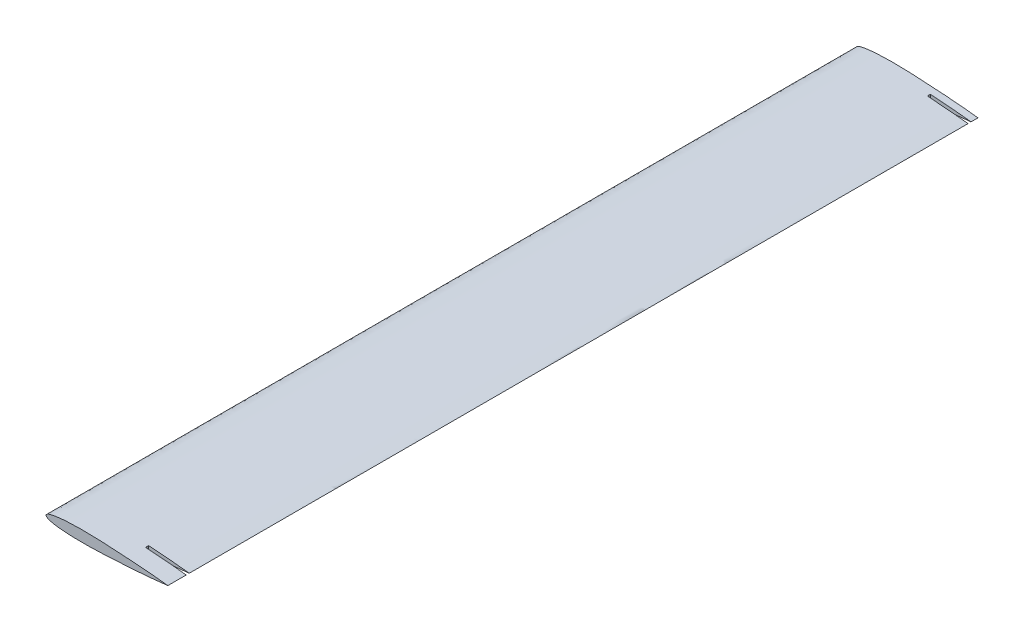
ISO-10303-21;
HEADER;
FILE_DESCRIPTION(('STEP AP214'),'2;1');
FILE_NAME('part.step','',(''),(''),'','','');
FILE_SCHEMA(('AUTOMOTIVE_DESIGN { 1 0 10303 214 1 1 1 1 }'));
ENDSEC;
DATA;
#1=APPLICATION_CONTEXT('core data for automotive mechanical design processes');
#2=APPLICATION_PROTOCOL_DEFINITION('international standard','automotive_design',2000,#1);
#3=PRODUCT_CONTEXT('',#1,'mechanical');
#4=PRODUCT('Part','Part','',(#3));
#5=PRODUCT_RELATED_PRODUCT_CATEGORY('part','',(#4));
#6=PRODUCT_DEFINITION_FORMATION('','',#4);
#7=PRODUCT_DEFINITION_CONTEXT('part definition',#1,'design');
#8=PRODUCT_DEFINITION('design','',#6,#7);
#9=PRODUCT_DEFINITION_SHAPE('','',#8);
#10=(LENGTH_UNIT() NAMED_UNIT(*) SI_UNIT(.MILLI.,.METRE.));
#11=(NAMED_UNIT(*) PLANE_ANGLE_UNIT() SI_UNIT($,.RADIAN.));
#12=(NAMED_UNIT(*) SI_UNIT($,.STERADIAN.) SOLID_ANGLE_UNIT());
#13=UNCERTAINTY_MEASURE_WITH_UNIT(LENGTH_MEASURE(1.E-05),#10,'distance_accuracy_value','');
#14=(GEOMETRIC_REPRESENTATION_CONTEXT(3) GLOBAL_UNCERTAINTY_ASSIGNED_CONTEXT((#13)) GLOBAL_UNIT_ASSIGNED_CONTEXT((#10,
#11,#12)) REPRESENTATION_CONTEXT('',''));
#15=CARTESIAN_POINT('',(0.,0.,0.));
#16=DIRECTION('',(0.,0.,1.));
#17=DIRECTION('',(1.,0.,0.));
#18=AXIS2_PLACEMENT_3D('',#15,#16,#17);
#19=CARTESIAN_POINT('',(200.,0.,1330.));
#20=CARTESIAN_POINT('',(200.,0.0382081789382283,1330.));
#21=CARTESIAN_POINT('',(198.17304904431,0.190225049855714,1330.));
#22=CARTESIAN_POINT('',(196.299321827907,0.507442706254723,1330.));
#23=CARTESIAN_POINT('',(191.747902409713,0.993763140540347,1330.));
#24=CARTESIAN_POINT('',(186.15583551062,1.59742483887089,1330.));
#25=CARTESIAN_POINT('',(178.869410335489,2.30581672072034,1330.));
#26=CARTESIAN_POINT('',(170.31474626905,3.08757355077791,1330.));
#27=CARTESIAN_POINT('',(160.529272093653,3.92759907002483,1330.));
#28=CARTESIAN_POINT('',(149.717754924415,4.80131235923475,1330.));
#29=CARTESIAN_POINT('',(138.052566354673,5.67381446541815,1330.));
#30=CARTESIAN_POINT('',(125.737106614075,6.5192525876967,1330.));
#31=CARTESIAN_POINT('',(112.981210062335,7.29872388413823,1330.));
#32=CARTESIAN_POINT('',(100.003286779257,7.97921904733727,1330.));
#33=CARTESIAN_POINT('',(87.0249277535441,8.52028632172407,1330.));
#34=CARTESIAN_POINT('',(76.3086521254569,8.83285185574405,1330.));
#35=CARTESIAN_POINT('',(67.9023437895598,8.97644226723843,1330.));
#36=CARTESIAN_POINT('',(61.7867743061123,9.02740184163897,1330.));
#37=CARTESIAN_POINT('',(55.8344160189546,9.0202834113506,1330.));
#38=CARTESIAN_POINT('',(50.0707275159979,8.943660593386,1330.));
#39=CARTESIAN_POINT('',(44.5208388481526,8.80916209633754,1330.));
#40=CARTESIAN_POINT('',(39.2089744336134,8.6060402435244,1330.));
#41=CARTESIAN_POINT('',(34.1574590264249,8.34169117101135,1330.));
#42=CARTESIAN_POINT('',(29.3872557912349,8.00995266432045,1330.));
#43=CARTESIAN_POINT('',(24.9185915320316,7.6164380254828,1330.));
#44=CARTESIAN_POINT('',(20.7720459522843,7.15770178176542,1330.));
#45=CARTESIAN_POINT('',(16.9649026364116,6.64248930510332,1330.));
#46=CARTESIAN_POINT('',(13.5120476934643,6.08408238005927,1330.));
#47=CARTESIAN_POINT('',(10.4278612724919,5.48498209465953,1330.));
#48=CARTESIAN_POINT('',(7.72236247681685,4.84726467704815,1330.));
#49=CARTESIAN_POINT('',(5.40836345531859,4.14945370834077,1330.));
#50=CARTESIAN_POINT('',(3.49088680786182,3.378624358705,1330.));
#51=CARTESIAN_POINT('',(1.98747725777448,2.52812023699052,1330.));
#52=CARTESIAN_POINT('',(0.906342382598221,1.64000623579424,1330.));
#53=CARTESIAN_POINT('',(0.231166118930239,0.826014489325518,1330.));
#54=CARTESIAN_POINT('',(-0.0945931385274746,0.,1330.));
#55=CARTESIAN_POINT('',(0.231166118930244,-0.826014489325538,1330.));
#56=CARTESIAN_POINT('',(0.906342382598231,-1.64000623579424,1330.));
#57=CARTESIAN_POINT('',(1.98747725777446,-2.5281202369905,1330.));
#58=CARTESIAN_POINT('',(3.49088680786185,-3.37862435870502,1330.));
#59=CARTESIAN_POINT('',(5.40836345531857,-4.14945370834076,1330.));
#60=CARTESIAN_POINT('',(7.72236247681685,-4.84726467704816,1330.));
#61=CARTESIAN_POINT('',(10.4278612724919,-5.48498209465952,1330.));
#62=CARTESIAN_POINT('',(13.5120476934643,-6.08408238005928,1330.));
#63=CARTESIAN_POINT('',(16.9649026364116,-6.64248930510331,1330.));
#64=CARTESIAN_POINT('',(20.7720459522843,-7.15770178176542,1330.));
#65=CARTESIAN_POINT('',(24.9185915320316,-7.6164380254828,1330.));
#66=CARTESIAN_POINT('',(29.3872557912349,-8.00995266432045,1330.));
#67=CARTESIAN_POINT('',(34.1574590264249,-8.34169117101135,1330.));
#68=CARTESIAN_POINT('',(39.2089744336134,-8.6060402435244,1330.));
#69=CARTESIAN_POINT('',(44.5208388481527,-8.80916209633753,1330.));
#70=CARTESIAN_POINT('',(50.0707275159979,-8.94366059338599,1330.));
#71=CARTESIAN_POINT('',(55.8344160189547,-9.0202834113506,1330.));
#72=CARTESIAN_POINT('',(61.7867743061123,-9.02740184163897,1330.));
#73=CARTESIAN_POINT('',(67.9023437895597,-8.97644226723844,1330.));
#74=CARTESIAN_POINT('',(76.308652125457,-8.83285185574405,1330.));
#75=CARTESIAN_POINT('',(87.024927753544,-8.52028632172406,1330.));
#76=CARTESIAN_POINT('',(100.003286779257,-7.97921904733727,1330.));
#77=CARTESIAN_POINT('',(112.981210062335,-7.29872388413822,1330.));
#78=CARTESIAN_POINT('',(125.737106614075,-6.5192525876967,1330.));
#79=CARTESIAN_POINT('',(138.052566354673,-5.67381446541815,1330.));
#80=CARTESIAN_POINT('',(149.717754924415,-4.80131235923475,1330.));
#81=CARTESIAN_POINT('',(160.529272093653,-3.92759907002483,1330.));
#82=CARTESIAN_POINT('',(170.31474626905,-3.08757355077791,1330.));
#83=CARTESIAN_POINT('',(178.869410335489,-2.30581672072034,1330.));
#84=CARTESIAN_POINT('',(186.15583551062,-1.59742483887089,1330.));
#85=CARTESIAN_POINT('',(191.747902409713,-0.993763140540349,1330.));
#86=CARTESIAN_POINT('',(196.299321827907,-0.507442706254724,1330.));
#87=CARTESIAN_POINT('',(198.17304904431,-0.190225049855715,1330.));
#88=CARTESIAN_POINT('',(200.,-0.0382081789382284,1330.));
#89=CARTESIAN_POINT('',(200.,0.,1330.));
#90=B_SPLINE_CURVE_WITH_KNOTS('',3,(#19,#20,#21,#22,#23,#24,#25,#26,#27,#28,#29,#30,#31,#32,#33,
#34,#35,#36,#37,#38,#39,#40,#41,#42,#43,#44,#45,#46,#47,#48,#49,#50,#51,#52,#53,#54,#55,#56,#57,
#58,#59,#60,#61,#62,#63,#64,#65,#66,#67,#68,#69,#70,#71,#72,#73,#74,#75,#76,#77,#78,#79,#80,#81,
#82,#83,#84,#85,#86,#87,#88,#89),.UNSPECIFIED.,.T.,.F.,(4,1,1,1,1,1,1,1,1,1,1,1,1,1,1,1,1,1,1,1,
1,1,1,1,1,1,1,1,1,1,1,1,1,1,1,1,1,1,1,1,1,1,1,1,1,1,1,1,1,1,1,1,1,1,1,1,1,1,1,1,1,1,1,1,1,1,1,1,
4),(0.,0.0021334274953682,0.00848815570874328,0.0189444871418497,0.0333191137755611,
0.0513562940971698,0.0727560928984786,0.0971408174352606,0.124097488782512,0.153162556777752,
0.183833917661664,0.21558937445911,0.247878194577005,0.280150867864074,0.311860397032406,
0.327332942728477,0.342462846119516,0.35718710244681,0.371448118351621,0.385183441042633,
0.398331272584713,0.410844637191414,0.422672607167312,0.433769314473499,0.444090175228778,
0.453589411782157,0.462240439844477,0.470010037325291,0.476870984677,0.482833353063501,
0.487908551351284,0.492155163583175,0.495592273393841,0.498196358984712,0.5,0.501803641015288,
0.504407726606159,0.507844836416825,0.512091448648716,0.517166646936499,0.523129015323001,
0.529989962674709,0.537759560155523,0.546410588217844,0.555909824771222,0.566230685526501,
0.577327392832688,0.589155362808586,0.601668727415287,0.614816558957367,0.62855188164838,
0.64281289755319,0.657537153880484,0.672667057271523,0.688139602967594,0.719849132135926,
0.752121805422996,0.78441062554089,0.816166082338336,0.846837443222248,0.875902511217488,
0.90285918256474,0.927243907101521,0.94864370590283,0.966680886224439,0.98105551285815,
0.991511844291257,0.997866572504632,1.),.UNSPECIFIED.);
#91=DIRECTION('',(0.,0.,-1.));
#92=VECTOR('',#91,1.);
#93=SURFACE_OF_LINEAR_EXTRUSION('',#90,#92);
#94=CARTESIAN_POINT('',(200.,0.,16.449359742962));
#95=CARTESIAN_POINT('',(200.,0.0382081789382283,16.449359742962));
#96=CARTESIAN_POINT('',(198.17304904431,0.190225049855714,16.449359742962));
#97=CARTESIAN_POINT('',(196.299321827907,0.507442706254723,16.449359742962));
#98=CARTESIAN_POINT('',(191.747902409713,0.993763140540347,16.449359742962));
#99=CARTESIAN_POINT('',(186.15583551062,1.59742483887089,16.449359742962));
#100=CARTESIAN_POINT('',(178.869410335489,2.30581672072034,16.449359742962));
#101=CARTESIAN_POINT('',(170.31474626905,3.08757355077791,16.449359742962));
#102=CARTESIAN_POINT('',(160.529272093653,3.92759907002483,16.449359742962));
#103=CARTESIAN_POINT('',(149.717754924415,4.80131235923475,16.449359742962));
#104=CARTESIAN_POINT('',(138.052566354673,5.67381446541815,16.449359742962));
#105=CARTESIAN_POINT('',(125.737106614075,6.5192525876967,16.449359742962));
#106=CARTESIAN_POINT('',(112.981210062335,7.29872388413823,16.449359742962));
#107=CARTESIAN_POINT('',(100.003286779257,7.97921904733727,16.449359742962));
#108=CARTESIAN_POINT('',(87.0249277535441,8.52028632172407,16.449359742962));
#109=CARTESIAN_POINT('',(76.3086521254569,8.83285185574405,16.449359742962));
#110=CARTESIAN_POINT('',(67.9023437895598,8.97644226723843,16.449359742962));
#111=CARTESIAN_POINT('',(61.7867743061123,9.02740184163897,16.449359742962));
#112=CARTESIAN_POINT('',(55.8344160189546,9.0202834113506,16.449359742962));
#113=CARTESIAN_POINT('',(50.0707275159979,8.943660593386,16.449359742962));
#114=CARTESIAN_POINT('',(44.5208388481526,8.80916209633754,16.449359742962));
#115=CARTESIAN_POINT('',(39.2089744336134,8.6060402435244,16.449359742962));
#116=CARTESIAN_POINT('',(34.1574590264249,8.34169117101135,16.449359742962));
#117=CARTESIAN_POINT('',(29.3872557912349,8.00995266432045,16.449359742962));
#118=CARTESIAN_POINT('',(24.9185915320316,7.6164380254828,16.449359742962));
#119=CARTESIAN_POINT('',(20.7720459522843,7.15770178176542,16.449359742962));
#120=CARTESIAN_POINT('',(16.9649026364116,6.64248930510332,16.449359742962));
#121=CARTESIAN_POINT('',(13.5120476934643,6.08408238005927,16.449359742962));
#122=CARTESIAN_POINT('',(10.4278612724919,5.48498209465953,16.449359742962));
#123=CARTESIAN_POINT('',(7.72236247681685,4.84726467704815,16.449359742962));
#124=CARTESIAN_POINT('',(5.40836345531859,4.14945370834077,16.449359742962));
#125=CARTESIAN_POINT('',(3.49088680786182,3.378624358705,16.449359742962));
#126=CARTESIAN_POINT('',(1.98747725777448,2.52812023699052,16.449359742962));
#127=CARTESIAN_POINT('',(0.906342382598221,1.64000623579424,16.449359742962));
#128=CARTESIAN_POINT('',(0.231166118930239,0.826014489325518,16.449359742962));
#129=CARTESIAN_POINT('',(-0.0945931385274746,0.,16.449359742962));
#130=CARTESIAN_POINT('',(0.231166118930244,-0.826014489325538,16.449359742962));
#131=CARTESIAN_POINT('',(0.906342382598231,-1.64000623579424,16.449359742962));
#132=CARTESIAN_POINT('',(1.98747725777446,-2.5281202369905,16.449359742962));
#133=CARTESIAN_POINT('',(3.49088680786185,-3.37862435870502,16.449359742962));
#134=CARTESIAN_POINT('',(5.40836345531857,-4.14945370834076,16.449359742962));
#135=CARTESIAN_POINT('',(7.72236247681685,-4.84726467704816,16.449359742962));
#136=CARTESIAN_POINT('',(10.4278612724919,-5.48498209465952,16.449359742962));
#137=CARTESIAN_POINT('',(13.5120476934643,-6.08408238005928,16.449359742962));
#138=CARTESIAN_POINT('',(16.9649026364116,-6.64248930510331,16.449359742962));
#139=CARTESIAN_POINT('',(20.7720459522843,-7.15770178176542,16.449359742962));
#140=CARTESIAN_POINT('',(24.9185915320316,-7.6164380254828,16.449359742962));
#141=CARTESIAN_POINT('',(29.3872557912349,-8.00995266432045,16.449359742962));
#142=CARTESIAN_POINT('',(34.1574590264249,-8.34169117101135,16.449359742962));
#143=CARTESIAN_POINT('',(39.2089744336134,-8.6060402435244,16.449359742962));
#144=CARTESIAN_POINT('',(44.5208388481527,-8.80916209633753,16.449359742962));
#145=CARTESIAN_POINT('',(50.0707275159979,-8.94366059338599,16.449359742962));
#146=CARTESIAN_POINT('',(55.8344160189547,-9.0202834113506,16.449359742962));
#147=CARTESIAN_POINT('',(61.7867743061123,-9.02740184163897,16.449359742962));
#148=CARTESIAN_POINT('',(67.9023437895597,-8.97644226723844,16.449359742962));
#149=CARTESIAN_POINT('',(76.308652125457,-8.83285185574405,16.449359742962));
#150=CARTESIAN_POINT('',(87.024927753544,-8.52028632172406,16.449359742962));
#151=CARTESIAN_POINT('',(100.003286779257,-7.97921904733727,16.449359742962));
#152=CARTESIAN_POINT('',(112.981210062335,-7.29872388413822,16.449359742962));
#153=CARTESIAN_POINT('',(125.737106614075,-6.5192525876967,16.449359742962));
#154=CARTESIAN_POINT('',(138.052566354673,-5.67381446541815,16.449359742962));
#155=CARTESIAN_POINT('',(149.717754924415,-4.80131235923475,16.449359742962));
#156=CARTESIAN_POINT('',(160.529272093653,-3.92759907002483,16.449359742962));
#157=CARTESIAN_POINT('',(170.31474626905,-3.08757355077791,16.449359742962));
#158=CARTESIAN_POINT('',(178.869410335489,-2.30581672072034,16.449359742962));
#159=CARTESIAN_POINT('',(186.15583551062,-1.59742483887089,16.449359742962));
#160=CARTESIAN_POINT('',(191.747902409713,-0.993763140540349,16.449359742962));
#161=CARTESIAN_POINT('',(196.299321827907,-0.507442706254724,16.449359742962));
#162=CARTESIAN_POINT('',(198.17304904431,-0.190225049855715,16.449359742962));
#163=CARTESIAN_POINT('',(200.,-0.0382081789382284,16.449359742962));
#164=CARTESIAN_POINT('',(200.,0.,16.449359742962));
#165=B_SPLINE_CURVE_WITH_KNOTS('',3,(#94,#95,#96,#97,#98,#99,#100,#101,#102,#103,#104,#105,#106,
#107,#108,#109,#110,#111,#112,#113,#114,#115,#116,#117,#118,#119,#120,#121,#122,#123,#124,#125,
#126,#127,#128,#129,#130,#131,#132,#133,#134,#135,#136,#137,#138,#139,#140,#141,#142,#143,#144,
#145,#146,#147,#148,#149,#150,#151,#152,#153,#154,#155,#156,#157,#158,#159,#160,#161,#162,#163,
#164),.UNSPECIFIED.,.T.,.F.,(4,1,1,1,1,1,1,1,1,1,1,1,1,1,1,1,1,1,1,1,1,1,1,1,1,1,1,1,1,1,1,1,1,
1,1,1,1,1,1,1,1,1,1,1,1,1,1,1,1,1,1,1,1,1,1,1,1,1,1,1,1,1,1,1,1,1,1,1,4),(0.,0.0021334274953682,
0.00848815570874328,0.0189444871418497,0.0333191137755611,0.0513562940971698,0.0727560928984786,
0.0971408174352606,0.124097488782512,0.153162556777752,0.183833917661664,0.21558937445911,
0.247878194577005,0.280150867864074,0.311860397032406,0.327332942728477,0.342462846119516,
0.35718710244681,0.371448118351621,0.385183441042633,0.398331272584713,0.410844637191414,
0.422672607167312,0.433769314473499,0.444090175228778,0.453589411782157,0.462240439844477,
0.470010037325291,0.476870984677,0.482833353063501,0.487908551351284,0.492155163583175,
0.495592273393841,0.498196358984712,0.5,0.501803641015288,0.504407726606159,0.507844836416825,
0.512091448648716,0.517166646936499,0.523129015323001,0.529989962674709,0.537759560155523,
0.546410588217844,0.555909824771222,0.566230685526501,0.577327392832688,0.589155362808586,
0.601668727415287,0.614816558957367,0.62855188164838,0.64281289755319,0.657537153880484,
0.672667057271523,0.688139602967594,0.719849132135926,0.752121805422996,0.78441062554089,
0.816166082338336,0.846837443222248,0.875902511217488,0.90285918256474,0.927243907101521,
0.94864370590283,0.966680886224439,0.98105551285815,0.991511844291257,0.997866572504632,1.),.UNSPECIFIED.);
#166=CARTESIAN_POINT('',(133.388793038963,5.99014061857719,16.4493597429621));
#167=VERTEX_POINT('',#166);
#168=CARTESIAN_POINT('',(133.388793038963,-5.99014061857719,16.4493597429621));
#169=VERTEX_POINT('',#168);
#170=EDGE_CURVE('E79',#167,#169,#165,.F.);
#171=ORIENTED_EDGE('',*,*,#170,.F.);
#172=DIRECTION('',(0.,0.,-1.));
#173=VECTOR('',#172,1.);
#174=CARTESIAN_POINT('',(133.388793038964,5.99014061992773,1330.));
#175=LINE('',#174,#173);
#176=CARTESIAN_POINT('',(133.388793038963,5.99014061857719,11.4493597429621));
#177=VERTEX_POINT('',#176);
#178=EDGE_CURVE('E98',#177,#167,#175,.F.);
#179=ORIENTED_EDGE('',*,*,#178,.F.);
#180=CARTESIAN_POINT('',(200.,0.,11.4493597429621));
#181=CARTESIAN_POINT('',(200.,0.0382081789382283,11.4493597429621));
#182=CARTESIAN_POINT('',(198.17304904431,0.190225049855714,11.4493597429621));
#183=CARTESIAN_POINT('',(196.299321827907,0.507442706254723,11.4493597429621));
#184=CARTESIAN_POINT('',(191.747902409713,0.993763140540347,11.4493597429621));
#185=CARTESIAN_POINT('',(186.15583551062,1.59742483887089,11.4493597429621));
#186=CARTESIAN_POINT('',(178.869410335489,2.30581672072034,11.4493597429621));
#187=CARTESIAN_POINT('',(170.31474626905,3.08757355077791,11.4493597429621));
#188=CARTESIAN_POINT('',(160.529272093653,3.92759907002483,11.4493597429621));
#189=CARTESIAN_POINT('',(149.717754924415,4.80131235923475,11.4493597429621));
#190=CARTESIAN_POINT('',(138.052566354673,5.67381446541815,11.4493597429621));
#191=CARTESIAN_POINT('',(125.737106614075,6.5192525876967,11.4493597429621));
#192=CARTESIAN_POINT('',(112.981210062335,7.29872388413823,11.4493597429621));
#193=CARTESIAN_POINT('',(100.003286779257,7.97921904733727,11.4493597429621));
#194=CARTESIAN_POINT('',(87.0249277535441,8.52028632172407,11.4493597429621));
#195=CARTESIAN_POINT('',(76.3086521254569,8.83285185574405,11.4493597429621));
#196=CARTESIAN_POINT('',(67.9023437895598,8.97644226723843,11.4493597429621));
#197=CARTESIAN_POINT('',(61.7867743061123,9.02740184163897,11.4493597429621));
#198=CARTESIAN_POINT('',(55.8344160189546,9.0202834113506,11.4493597429621));
#199=CARTESIAN_POINT('',(50.0707275159979,8.943660593386,11.4493597429621));
#200=CARTESIAN_POINT('',(44.5208388481526,8.80916209633754,11.4493597429621));
#201=CARTESIAN_POINT('',(39.2089744336134,8.6060402435244,11.4493597429621));
#202=CARTESIAN_POINT('',(34.1574590264249,8.34169117101135,11.4493597429621));
#203=CARTESIAN_POINT('',(29.3872557912349,8.00995266432045,11.4493597429621));
#204=CARTESIAN_POINT('',(24.9185915320316,7.6164380254828,11.4493597429621));
#205=CARTESIAN_POINT('',(20.7720459522843,7.15770178176542,11.4493597429621));
#206=CARTESIAN_POINT('',(16.9649026364116,6.64248930510332,11.4493597429621));
#207=CARTESIAN_POINT('',(13.5120476934643,6.08408238005927,11.4493597429621));
#208=CARTESIAN_POINT('',(10.4278612724919,5.48498209465953,11.4493597429621));
#209=CARTESIAN_POINT('',(7.72236247681685,4.84726467704815,11.4493597429621));
#210=CARTESIAN_POINT('',(5.40836345531859,4.14945370834077,11.4493597429621));
#211=CARTESIAN_POINT('',(3.49088680786182,3.378624358705,11.4493597429621));
#212=CARTESIAN_POINT('',(1.98747725777448,2.52812023699052,11.4493597429621));
#213=CARTESIAN_POINT('',(0.906342382598221,1.64000623579424,11.4493597429621));
#214=CARTESIAN_POINT('',(0.231166118930239,0.826014489325518,11.4493597429621));
#215=CARTESIAN_POINT('',(-0.0945931385274746,0.,11.4493597429621));
#216=CARTESIAN_POINT('',(0.231166118930244,-0.826014489325538,11.4493597429621));
#217=CARTESIAN_POINT('',(0.906342382598231,-1.64000623579424,11.4493597429621));
#218=CARTESIAN_POINT('',(1.98747725777446,-2.5281202369905,11.4493597429621));
#219=CARTESIAN_POINT('',(3.49088680786185,-3.37862435870502,11.4493597429621));
#220=CARTESIAN_POINT('',(5.40836345531857,-4.14945370834076,11.4493597429621));
#221=CARTESIAN_POINT('',(7.72236247681685,-4.84726467704816,11.4493597429621));
#222=CARTESIAN_POINT('',(10.4278612724919,-5.48498209465952,11.4493597429621));
#223=CARTESIAN_POINT('',(13.5120476934643,-6.08408238005928,11.4493597429621));
#224=CARTESIAN_POINT('',(16.9649026364116,-6.64248930510331,11.4493597429621));
#225=CARTESIAN_POINT('',(20.7720459522843,-7.15770178176542,11.4493597429621));
#226=CARTESIAN_POINT('',(24.9185915320316,-7.6164380254828,11.4493597429621));
#227=CARTESIAN_POINT('',(29.3872557912349,-8.00995266432045,11.4493597429621));
#228=CARTESIAN_POINT('',(34.1574590264249,-8.34169117101135,11.4493597429621));
#229=CARTESIAN_POINT('',(39.2089744336134,-8.6060402435244,11.4493597429621));
#230=CARTESIAN_POINT('',(44.5208388481527,-8.80916209633753,11.4493597429621));
#231=CARTESIAN_POINT('',(50.0707275159979,-8.94366059338599,11.4493597429621));
#232=CARTESIAN_POINT('',(55.8344160189547,-9.0202834113506,11.4493597429621));
#233=CARTESIAN_POINT('',(61.7867743061123,-9.02740184163897,11.4493597429621));
#234=CARTESIAN_POINT('',(67.9023437895597,-8.97644226723844,11.4493597429621));
#235=CARTESIAN_POINT('',(76.308652125457,-8.83285185574405,11.4493597429621));
#236=CARTESIAN_POINT('',(87.024927753544,-8.52028632172406,11.4493597429621));
#237=CARTESIAN_POINT('',(100.003286779257,-7.97921904733727,11.4493597429621));
#238=CARTESIAN_POINT('',(112.981210062335,-7.29872388413822,11.4493597429621));
#239=CARTESIAN_POINT('',(125.737106614075,-6.5192525876967,11.4493597429621));
#240=CARTESIAN_POINT('',(138.052566354673,-5.67381446541815,11.4493597429621));
#241=CARTESIAN_POINT('',(149.717754924415,-4.80131235923475,11.4493597429621));
#242=CARTESIAN_POINT('',(160.529272093653,-3.92759907002483,11.4493597429621));
#243=CARTESIAN_POINT('',(170.31474626905,-3.08757355077791,11.4493597429621));
#244=CARTESIAN_POINT('',(178.869410335489,-2.30581672072034,11.4493597429621));
#245=CARTESIAN_POINT('',(186.15583551062,-1.59742483887089,11.4493597429621));
#246=CARTESIAN_POINT('',(191.747902409713,-0.993763140540349,11.4493597429621));
#247=CARTESIAN_POINT('',(196.299321827907,-0.507442706254724,11.4493597429621));
#248=CARTESIAN_POINT('',(198.17304904431,-0.190225049855715,11.4493597429621));
#249=CARTESIAN_POINT('',(200.,-0.0382081789382284,11.4493597429621));
#250=CARTESIAN_POINT('',(200.,0.,11.4493597429621));
#251=B_SPLINE_CURVE_WITH_KNOTS('',3,(#180,#181,#182,#183,#184,#185,#186,#187,#188,#189,#190,
#191,#192,#193,#194,#195,#196,#197,#198,#199,#200,#201,#202,#203,#204,#205,#206,#207,#208,#209,
#210,#211,#212,#213,#214,#215,#216,#217,#218,#219,#220,#221,#222,#223,#224,#225,#226,#227,#228,
#229,#230,#231,#232,#233,#234,#235,#236,#237,#238,#239,#240,#241,#242,#243,#244,#245,#246,#247,
#248,#249,#250),.UNSPECIFIED.,.T.,.F.,(4,1,1,1,1,1,1,1,1,1,1,1,1,1,1,1,1,1,1,1,1,1,1,1,1,1,1,1,
1,1,1,1,1,1,1,1,1,1,1,1,1,1,1,1,1,1,1,1,1,1,1,1,1,1,1,1,1,1,1,1,1,1,1,1,1,1,1,1,4),(0.,
0.0021334274953682,0.00848815570874328,0.0189444871418497,0.0333191137755611,0.0513562940971698,
0.0727560928984786,0.0971408174352606,0.124097488782512,0.153162556777752,0.183833917661664,
0.21558937445911,0.247878194577005,0.280150867864074,0.311860397032406,0.327332942728477,
0.342462846119516,0.35718710244681,0.371448118351621,0.385183441042633,0.398331272584713,
0.410844637191414,0.422672607167312,0.433769314473499,0.444090175228778,0.453589411782157,
0.462240439844477,0.470010037325291,0.476870984677,0.482833353063501,0.487908551351284,
0.492155163583175,0.495592273393841,0.498196358984712,0.5,0.501803641015288,0.504407726606159,
0.507844836416825,0.512091448648716,0.517166646936499,0.523129015323001,0.529989962674709,
0.537759560155523,0.546410588217844,0.555909824771222,0.566230685526501,0.577327392832688,
0.589155362808586,0.601668727415287,0.614816558957367,0.62855188164838,0.64281289755319,
0.657537153880484,0.672667057271523,0.688139602967594,0.719849132135926,0.752121805422996,
0.78441062554089,0.816166082338336,0.846837443222248,0.875902511217488,0.90285918256474,
0.927243907101521,0.94864370590283,0.966680886224439,0.98105551285815,0.991511844291257,
0.997866572504632,1.),.UNSPECIFIED.);
#252=CARTESIAN_POINT('',(133.388793058471,-5.99014061857719,11.4493597429621));
#253=VERTEX_POINT('',#252);
#254=EDGE_CURVE('E105',#253,#177,#251,.T.);
#255=ORIENTED_EDGE('',*,*,#254,.F.);
#256=DIRECTION('',(0.,0.,-1.));
#257=VECTOR('',#256,1.);
#258=CARTESIAN_POINT('',(133.388793038963,-5.99014061992773,1330.));
#259=LINE('',#258,#257);
#260=EDGE_CURVE('E103',#169,#253,#259,.T.);
#261=ORIENTED_EDGE('',*,*,#260,.F.);
#262=EDGE_LOOP('',(#171,#179,#255,#261));
#263=FACE_BOUND('',#262,.T.);
#264=CARTESIAN_POINT('',(200.,0.,1330.));
#265=VERTEX_POINT('',#264);
#266=EDGE_CURVE('E109',#265,#265,#90,.T.);
#267=ORIENTED_EDGE('',*,*,#266,.F.);
#268=EDGE_LOOP('',(#267));
#269=FACE_BOUND('',#268,.T.);
#270=CARTESIAN_POINT('',(200.,0.,0.));
#271=CARTESIAN_POINT('',(200.,0.0382081789382283,0.));
#272=CARTESIAN_POINT('',(198.17304904431,0.190225049855714,0.));
#273=CARTESIAN_POINT('',(196.299321827907,0.507442706254723,0.));
#274=CARTESIAN_POINT('',(191.747902409713,0.993763140540347,0.));
#275=CARTESIAN_POINT('',(186.15583551062,1.59742483887089,0.));
#276=CARTESIAN_POINT('',(178.869410335489,2.30581672072034,0.));
#277=CARTESIAN_POINT('',(170.31474626905,3.08757355077791,0.));
#278=CARTESIAN_POINT('',(160.529272093653,3.92759907002483,0.));
#279=CARTESIAN_POINT('',(149.717754924415,4.80131235923475,0.));
#280=CARTESIAN_POINT('',(138.052566354673,5.67381446541815,0.));
#281=CARTESIAN_POINT('',(125.737106614075,6.5192525876967,0.));
#282=CARTESIAN_POINT('',(112.981210062335,7.29872388413823,0.));
#283=CARTESIAN_POINT('',(100.003286779257,7.97921904733727,0.));
#284=CARTESIAN_POINT('',(87.0249277535441,8.52028632172407,0.));
#285=CARTESIAN_POINT('',(76.3086521254569,8.83285185574405,0.));
#286=CARTESIAN_POINT('',(67.9023437895598,8.97644226723843,0.));
#287=CARTESIAN_POINT('',(61.7867743061123,9.02740184163897,0.));
#288=CARTESIAN_POINT('',(55.8344160189546,9.0202834113506,0.));
#289=CARTESIAN_POINT('',(50.0707275159979,8.943660593386,0.));
#290=CARTESIAN_POINT('',(44.5208388481526,8.80916209633754,0.));
#291=CARTESIAN_POINT('',(39.2089744336134,8.6060402435244,0.));
#292=CARTESIAN_POINT('',(34.1574590264249,8.34169117101135,0.));
#293=CARTESIAN_POINT('',(29.3872557912349,8.00995266432045,0.));
#294=CARTESIAN_POINT('',(24.9185915320316,7.6164380254828,0.));
#295=CARTESIAN_POINT('',(20.7720459522843,7.15770178176542,0.));
#296=CARTESIAN_POINT('',(16.9649026364116,6.64248930510332,0.));
#297=CARTESIAN_POINT('',(13.5120476934643,6.08408238005927,0.));
#298=CARTESIAN_POINT('',(10.4278612724919,5.48498209465953,0.));
#299=CARTESIAN_POINT('',(7.72236247681685,4.84726467704815,0.));
#300=CARTESIAN_POINT('',(5.40836345531859,4.14945370834077,0.));
#301=CARTESIAN_POINT('',(3.49088680786182,3.378624358705,0.));
#302=CARTESIAN_POINT('',(1.98747725777448,2.52812023699052,0.));
#303=CARTESIAN_POINT('',(0.906342382598221,1.64000623579424,0.));
#304=CARTESIAN_POINT('',(0.231166118930239,0.826014489325518,0.));
#305=CARTESIAN_POINT('',(-0.0945931385274746,0.,0.));
#306=CARTESIAN_POINT('',(0.231166118930244,-0.826014489325538,0.));
#307=CARTESIAN_POINT('',(0.906342382598231,-1.64000623579424,0.));
#308=CARTESIAN_POINT('',(1.98747725777446,-2.5281202369905,0.));
#309=CARTESIAN_POINT('',(3.49088680786185,-3.37862435870502,0.));
#310=CARTESIAN_POINT('',(5.40836345531857,-4.14945370834076,0.));
#311=CARTESIAN_POINT('',(7.72236247681685,-4.84726467704816,0.));
#312=CARTESIAN_POINT('',(10.4278612724919,-5.48498209465952,0.));
#313=CARTESIAN_POINT('',(13.5120476934643,-6.08408238005928,0.));
#314=CARTESIAN_POINT('',(16.9649026364116,-6.64248930510331,0.));
#315=CARTESIAN_POINT('',(20.7720459522843,-7.15770178176542,0.));
#316=CARTESIAN_POINT('',(24.9185915320316,-7.6164380254828,0.));
#317=CARTESIAN_POINT('',(29.3872557912349,-8.00995266432045,0.));
#318=CARTESIAN_POINT('',(34.1574590264249,-8.34169117101135,0.));
#319=CARTESIAN_POINT('',(39.2089744336134,-8.6060402435244,0.));
#320=CARTESIAN_POINT('',(44.5208388481527,-8.80916209633753,0.));
#321=CARTESIAN_POINT('',(50.0707275159979,-8.94366059338599,0.));
#322=CARTESIAN_POINT('',(55.8344160189547,-9.0202834113506,0.));
#323=CARTESIAN_POINT('',(61.7867743061123,-9.02740184163897,0.));
#324=CARTESIAN_POINT('',(67.9023437895597,-8.97644226723844,0.));
#325=CARTESIAN_POINT('',(76.308652125457,-8.83285185574405,0.));
#326=CARTESIAN_POINT('',(87.024927753544,-8.52028632172406,0.));
#327=CARTESIAN_POINT('',(100.003286779257,-7.97921904733727,0.));
#328=CARTESIAN_POINT('',(112.981210062335,-7.29872388413822,0.));
#329=CARTESIAN_POINT('',(125.737106614075,-6.5192525876967,0.));
#330=CARTESIAN_POINT('',(138.052566354673,-5.67381446541815,0.));
#331=CARTESIAN_POINT('',(149.717754924415,-4.80131235923475,0.));
#332=CARTESIAN_POINT('',(160.529272093653,-3.92759907002483,0.));
#333=CARTESIAN_POINT('',(170.31474626905,-3.08757355077791,0.));
#334=CARTESIAN_POINT('',(178.869410335489,-2.30581672072034,0.));
#335=CARTESIAN_POINT('',(186.15583551062,-1.59742483887089,0.));
#336=CARTESIAN_POINT('',(191.747902409713,-0.993763140540349,0.));
#337=CARTESIAN_POINT('',(196.299321827907,-0.507442706254724,0.));
#338=CARTESIAN_POINT('',(198.17304904431,-0.190225049855715,0.));
#339=CARTESIAN_POINT('',(200.,-0.0382081789382284,0.));
#340=CARTESIAN_POINT('',(200.,0.,0.));
#341=B_SPLINE_CURVE_WITH_KNOTS('',3,(#270,#271,#272,#273,#274,#275,#276,#277,#278,#279,#280,
#281,#282,#283,#284,#285,#286,#287,#288,#289,#290,#291,#292,#293,#294,#295,#296,#297,#298,#299,
#300,#301,#302,#303,#304,#305,#306,#307,#308,#309,#310,#311,#312,#313,#314,#315,#316,#317,#318,
#319,#320,#321,#322,#323,#324,#325,#326,#327,#328,#329,#330,#331,#332,#333,#334,#335,#336,#337,
#338,#339,#340),.UNSPECIFIED.,.T.,.F.,(4,1,1,1,1,1,1,1,1,1,1,1,1,1,1,1,1,1,1,1,1,1,1,1,1,1,1,1,
1,1,1,1,1,1,1,1,1,1,1,1,1,1,1,1,1,1,1,1,1,1,1,1,1,1,1,1,1,1,1,1,1,1,1,1,1,1,1,1,4),(0.,
0.0021334274953682,0.00848815570874328,0.0189444871418497,0.0333191137755611,0.0513562940971698,
0.0727560928984786,0.0971408174352606,0.124097488782512,0.153162556777752,0.183833917661664,
0.21558937445911,0.247878194577005,0.280150867864074,0.311860397032406,0.327332942728477,
0.342462846119516,0.35718710244681,0.371448118351621,0.385183441042633,0.398331272584713,
0.410844637191414,0.422672607167312,0.433769314473499,0.444090175228778,0.453589411782157,
0.462240439844477,0.470010037325291,0.476870984677,0.482833353063501,0.487908551351284,
0.492155163583175,0.495592273393841,0.498196358984712,0.5,0.501803641015288,0.504407726606159,
0.507844836416825,0.512091448648716,0.517166646936499,0.523129015323001,0.529989962674709,
0.537759560155523,0.546410588217844,0.555909824771222,0.566230685526501,0.577327392832688,
0.589155362808586,0.601668727415287,0.614816558957367,0.62855188164838,0.64281289755319,
0.657537153880484,0.672667057271523,0.688139602967594,0.719849132135926,0.752121805422996,
0.78441062554089,0.816166082338336,0.846837443222248,0.875902511217488,0.90285918256474,
0.927243907101521,0.94864370590283,0.966680886224439,0.98105551285815,0.991511844291257,
0.997866572504632,1.),.UNSPECIFIED.);
#342=CARTESIAN_POINT('',(200.,0.,0.));
#343=VERTEX_POINT('',#342);
#344=EDGE_CURVE('E110',#343,#343,#341,.T.);
#345=ORIENTED_EDGE('',*,*,#344,.T.);
#346=EDGE_LOOP('',(#345));
#347=FACE_BOUND('',#346,.T.);
#348=CARTESIAN_POINT('',(200.,0.,1299.83749618961));
#349=CARTESIAN_POINT('',(200.,0.0382081789382283,1299.83749618961));
#350=CARTESIAN_POINT('',(198.17304904431,0.190225049855714,1299.83749618961));
#351=CARTESIAN_POINT('',(196.299321827907,0.507442706254723,1299.83749618961));
#352=CARTESIAN_POINT('',(191.747902409713,0.993763140540347,1299.83749618961));
#353=CARTESIAN_POINT('',(186.15583551062,1.59742483887089,1299.83749618961));
#354=CARTESIAN_POINT('',(178.869410335489,2.30581672072034,1299.83749618961));
#355=CARTESIAN_POINT('',(170.31474626905,3.08757355077791,1299.83749618961));
#356=CARTESIAN_POINT('',(160.529272093653,3.92759907002483,1299.83749618961));
#357=CARTESIAN_POINT('',(149.717754924415,4.80131235923475,1299.83749618961));
#358=CARTESIAN_POINT('',(138.052566354673,5.67381446541815,1299.83749618961));
#359=CARTESIAN_POINT('',(125.737106614075,6.5192525876967,1299.83749618961));
#360=CARTESIAN_POINT('',(112.981210062335,7.29872388413823,1299.83749618961));
#361=CARTESIAN_POINT('',(100.003286779257,7.97921904733727,1299.83749618961));
#362=CARTESIAN_POINT('',(87.0249277535441,8.52028632172407,1299.83749618961));
#363=CARTESIAN_POINT('',(76.3086521254569,8.83285185574405,1299.83749618961));
#364=CARTESIAN_POINT('',(67.9023437895598,8.97644226723843,1299.83749618961));
#365=CARTESIAN_POINT('',(61.7867743061123,9.02740184163897,1299.83749618961));
#366=CARTESIAN_POINT('',(55.8344160189546,9.0202834113506,1299.83749618961));
#367=CARTESIAN_POINT('',(50.0707275159979,8.943660593386,1299.83749618961));
#368=CARTESIAN_POINT('',(44.5208388481526,8.80916209633754,1299.83749618961));
#369=CARTESIAN_POINT('',(39.2089744336134,8.6060402435244,1299.83749618961));
#370=CARTESIAN_POINT('',(34.1574590264249,8.34169117101135,1299.83749618961));
#371=CARTESIAN_POINT('',(29.3872557912349,8.00995266432045,1299.83749618961));
#372=CARTESIAN_POINT('',(24.9185915320316,7.6164380254828,1299.83749618961));
#373=CARTESIAN_POINT('',(20.7720459522843,7.15770178176542,1299.83749618961));
#374=CARTESIAN_POINT('',(16.9649026364116,6.64248930510332,1299.83749618961));
#375=CARTESIAN_POINT('',(13.5120476934643,6.08408238005927,1299.83749618961));
#376=CARTESIAN_POINT('',(10.4278612724919,5.48498209465953,1299.83749618961));
#377=CARTESIAN_POINT('',(7.72236247681685,4.84726467704815,1299.83749618961));
#378=CARTESIAN_POINT('',(5.40836345531859,4.14945370834077,1299.83749618961));
#379=CARTESIAN_POINT('',(3.49088680786182,3.378624358705,1299.83749618961));
#380=CARTESIAN_POINT('',(1.98747725777448,2.52812023699052,1299.83749618961));
#381=CARTESIAN_POINT('',(0.906342382598221,1.64000623579424,1299.83749618961));
#382=CARTESIAN_POINT('',(0.231166118930239,0.826014489325518,1299.83749618961));
#383=CARTESIAN_POINT('',(-0.0945931385274746,0.,1299.83749618961));
#384=CARTESIAN_POINT('',(0.231166118930244,-0.826014489325538,1299.83749618961));
#385=CARTESIAN_POINT('',(0.906342382598231,-1.64000623579424,1299.83749618961));
#386=CARTESIAN_POINT('',(1.98747725777446,-2.5281202369905,1299.83749618961));
#387=CARTESIAN_POINT('',(3.49088680786185,-3.37862435870502,1299.83749618961));
#388=CARTESIAN_POINT('',(5.40836345531857,-4.14945370834076,1299.83749618961));
#389=CARTESIAN_POINT('',(7.72236247681685,-4.84726467704816,1299.83749618961));
#390=CARTESIAN_POINT('',(10.4278612724919,-5.48498209465952,1299.83749618961));
#391=CARTESIAN_POINT('',(13.5120476934643,-6.08408238005928,1299.83749618961));
#392=CARTESIAN_POINT('',(16.9649026364116,-6.64248930510331,1299.83749618961));
#393=CARTESIAN_POINT('',(20.7720459522843,-7.15770178176542,1299.83749618961));
#394=CARTESIAN_POINT('',(24.9185915320316,-7.6164380254828,1299.83749618961));
#395=CARTESIAN_POINT('',(29.3872557912349,-8.00995266432045,1299.83749618961));
#396=CARTESIAN_POINT('',(34.1574590264249,-8.34169117101135,1299.83749618961));
#397=CARTESIAN_POINT('',(39.2089744336134,-8.6060402435244,1299.83749618961));
#398=CARTESIAN_POINT('',(44.5208388481527,-8.80916209633753,1299.83749618961));
#399=CARTESIAN_POINT('',(50.0707275159979,-8.94366059338599,1299.83749618961));
#400=CARTESIAN_POINT('',(55.8344160189547,-9.0202834113506,1299.83749618961));
#401=CARTESIAN_POINT('',(61.7867743061123,-9.02740184163897,1299.83749618961));
#402=CARTESIAN_POINT('',(67.9023437895597,-8.97644226723844,1299.83749618961));
#403=CARTESIAN_POINT('',(76.308652125457,-8.83285185574405,1299.83749618961));
#404=CARTESIAN_POINT('',(87.024927753544,-8.52028632172406,1299.83749618961));
#405=CARTESIAN_POINT('',(100.003286779257,-7.97921904733727,1299.83749618961));
#406=CARTESIAN_POINT('',(112.981210062335,-7.29872388413822,1299.83749618961));
#407=CARTESIAN_POINT('',(125.737106614075,-6.5192525876967,1299.83749618961));
#408=CARTESIAN_POINT('',(138.052566354673,-5.67381446541815,1299.83749618961));
#409=CARTESIAN_POINT('',(149.717754924415,-4.80131235923475,1299.83749618961));
#410=CARTESIAN_POINT('',(160.529272093653,-3.92759907002483,1299.83749618961));
#411=CARTESIAN_POINT('',(170.31474626905,-3.08757355077791,1299.83749618961));
#412=CARTESIAN_POINT('',(178.869410335489,-2.30581672072034,1299.83749618961));
#413=CARTESIAN_POINT('',(186.15583551062,-1.59742483887089,1299.83749618961));
#414=CARTESIAN_POINT('',(191.747902409713,-0.993763140540349,1299.83749618961));
#415=CARTESIAN_POINT('',(196.299321827907,-0.507442706254724,1299.83749618961));
#416=CARTESIAN_POINT('',(198.17304904431,-0.190225049855715,1299.83749618961));
#417=CARTESIAN_POINT('',(200.,-0.0382081789382284,1299.83749618961));
#418=CARTESIAN_POINT('',(200.,0.,1299.83749618961));
#419=B_SPLINE_CURVE_WITH_KNOTS('',3,(#348,#349,#350,#351,#352,#353,#354,#355,#356,#357,#358,
#359,#360,#361,#362,#363,#364,#365,#366,#367,#368,#369,#370,#371,#372,#373,#374,#375,#376,#377,
#378,#379,#380,#381,#382,#383,#384,#385,#386,#387,#388,#389,#390,#391,#392,#393,#394,#395,#396,
#397,#398,#399,#400,#401,#402,#403,#404,#405,#406,#407,#408,#409,#410,#411,#412,#413,#414,#415,
#416,#417,#418),.UNSPECIFIED.,.T.,.F.,(4,1,1,1,1,1,1,1,1,1,1,1,1,1,1,1,1,1,1,1,1,1,1,1,1,1,1,1,
1,1,1,1,1,1,1,1,1,1,1,1,1,1,1,1,1,1,1,1,1,1,1,1,1,1,1,1,1,1,1,1,1,1,1,1,1,1,1,1,4),(0.,
0.0021334274953682,0.00848815570874328,0.0189444871418497,0.0333191137755611,0.0513562940971698,
0.0727560928984786,0.0971408174352606,0.124097488782512,0.153162556777752,0.183833917661664,
0.21558937445911,0.247878194577005,0.280150867864074,0.311860397032406,0.327332942728477,
0.342462846119516,0.35718710244681,0.371448118351621,0.385183441042633,0.398331272584713,
0.410844637191414,0.422672607167312,0.433769314473499,0.444090175228778,0.453589411782157,
0.462240439844477,0.470010037325291,0.476870984677,0.482833353063501,0.487908551351284,
0.492155163583175,0.495592273393841,0.498196358984712,0.5,0.501803641015288,0.504407726606159,
0.507844836416825,0.512091448648716,0.517166646936499,0.523129015323001,0.529989962674709,
0.537759560155523,0.546410588217844,0.555909824771222,0.566230685526501,0.577327392832688,
0.589155362808586,0.601668727415287,0.614816558957367,0.62855188164838,0.64281289755319,
0.657537153880484,0.672667057271523,0.688139602967594,0.719849132135926,0.752121805422996,
0.78441062554089,0.816166082338336,0.846837443222248,0.875902511217488,0.90285918256474,
0.927243907101521,0.94864370590283,0.966680886224439,0.98105551285815,0.991511844291257,
0.997866572504632,1.),.UNSPECIFIED.);
#420=CARTESIAN_POINT('',(133.388793038963,5.99014061857719,1299.83749618961));
#421=VERTEX_POINT('',#420);
#422=CARTESIAN_POINT('',(133.388793038963,-5.99014061857719,1299.83749618961));
#423=VERTEX_POINT('',#422);
#424=EDGE_CURVE('E11',#421,#423,#419,.F.);
#425=ORIENTED_EDGE('',*,*,#424,.F.);
#426=DIRECTION('',(0.,0.,-1.));
#427=VECTOR('',#426,1.);
#428=CARTESIAN_POINT('',(133.388793038964,5.99014061992773,1330.));
#429=LINE('',#428,#427);
#430=CARTESIAN_POINT('',(133.388793038963,5.99014061857719,1294.83749618961));
#431=VERTEX_POINT('',#430);
#432=EDGE_CURVE('E43',#431,#421,#429,.F.);
#433=ORIENTED_EDGE('',*,*,#432,.F.);
#434=CARTESIAN_POINT('',(200.,0.,1294.83749618961));
#435=CARTESIAN_POINT('',(200.,0.0382081789382283,1294.83749618961));
#436=CARTESIAN_POINT('',(198.17304904431,0.190225049855714,1294.83749618961));
#437=CARTESIAN_POINT('',(196.299321827907,0.507442706254723,1294.83749618961));
#438=CARTESIAN_POINT('',(191.747902409713,0.993763140540347,1294.83749618961));
#439=CARTESIAN_POINT('',(186.15583551062,1.59742483887089,1294.83749618961));
#440=CARTESIAN_POINT('',(178.869410335489,2.30581672072034,1294.83749618961));
#441=CARTESIAN_POINT('',(170.31474626905,3.08757355077791,1294.83749618961));
#442=CARTESIAN_POINT('',(160.529272093653,3.92759907002483,1294.83749618961));
#443=CARTESIAN_POINT('',(149.717754924415,4.80131235923475,1294.83749618961));
#444=CARTESIAN_POINT('',(138.052566354673,5.67381446541815,1294.83749618961));
#445=CARTESIAN_POINT('',(125.737106614075,6.5192525876967,1294.83749618961));
#446=CARTESIAN_POINT('',(112.981210062335,7.29872388413823,1294.83749618961));
#447=CARTESIAN_POINT('',(100.003286779257,7.97921904733727,1294.83749618961));
#448=CARTESIAN_POINT('',(87.0249277535441,8.52028632172407,1294.83749618961));
#449=CARTESIAN_POINT('',(76.3086521254569,8.83285185574405,1294.83749618961));
#450=CARTESIAN_POINT('',(67.9023437895598,8.97644226723843,1294.83749618961));
#451=CARTESIAN_POINT('',(61.7867743061123,9.02740184163897,1294.83749618961));
#452=CARTESIAN_POINT('',(55.8344160189546,9.0202834113506,1294.83749618961));
#453=CARTESIAN_POINT('',(50.0707275159979,8.943660593386,1294.83749618961));
#454=CARTESIAN_POINT('',(44.5208388481526,8.80916209633754,1294.83749618961));
#455=CARTESIAN_POINT('',(39.2089744336134,8.6060402435244,1294.83749618961));
#456=CARTESIAN_POINT('',(34.1574590264249,8.34169117101135,1294.83749618961));
#457=CARTESIAN_POINT('',(29.3872557912349,8.00995266432045,1294.83749618961));
#458=CARTESIAN_POINT('',(24.9185915320316,7.6164380254828,1294.83749618961));
#459=CARTESIAN_POINT('',(20.7720459522843,7.15770178176542,1294.83749618961));
#460=CARTESIAN_POINT('',(16.9649026364116,6.64248930510332,1294.83749618961));
#461=CARTESIAN_POINT('',(13.5120476934643,6.08408238005927,1294.83749618961));
#462=CARTESIAN_POINT('',(10.4278612724919,5.48498209465953,1294.83749618961));
#463=CARTESIAN_POINT('',(7.72236247681685,4.84726467704815,1294.83749618961));
#464=CARTESIAN_POINT('',(5.40836345531859,4.14945370834077,1294.83749618961));
#465=CARTESIAN_POINT('',(3.49088680786182,3.378624358705,1294.83749618961));
#466=CARTESIAN_POINT('',(1.98747725777448,2.52812023699052,1294.83749618961));
#467=CARTESIAN_POINT('',(0.906342382598221,1.64000623579424,1294.83749618961));
#468=CARTESIAN_POINT('',(0.231166118930239,0.826014489325518,1294.83749618961));
#469=CARTESIAN_POINT('',(-0.0945931385274746,0.,1294.83749618961));
#470=CARTESIAN_POINT('',(0.231166118930244,-0.826014489325538,1294.83749618961));
#471=CARTESIAN_POINT('',(0.906342382598231,-1.64000623579424,1294.83749618961));
#472=CARTESIAN_POINT('',(1.98747725777446,-2.5281202369905,1294.83749618961));
#473=CARTESIAN_POINT('',(3.49088680786185,-3.37862435870502,1294.83749618961));
#474=CARTESIAN_POINT('',(5.40836345531857,-4.14945370834076,1294.83749618961));
#475=CARTESIAN_POINT('',(7.72236247681685,-4.84726467704816,1294.83749618961));
#476=CARTESIAN_POINT('',(10.4278612724919,-5.48498209465952,1294.83749618961));
#477=CARTESIAN_POINT('',(13.5120476934643,-6.08408238005928,1294.83749618961));
#478=CARTESIAN_POINT('',(16.9649026364116,-6.64248930510331,1294.83749618961));
#479=CARTESIAN_POINT('',(20.7720459522843,-7.15770178176542,1294.83749618961));
#480=CARTESIAN_POINT('',(24.9185915320316,-7.6164380254828,1294.83749618961));
#481=CARTESIAN_POINT('',(29.3872557912349,-8.00995266432045,1294.83749618961));
#482=CARTESIAN_POINT('',(34.1574590264249,-8.34169117101135,1294.83749618961));
#483=CARTESIAN_POINT('',(39.2089744336134,-8.6060402435244,1294.83749618961));
#484=CARTESIAN_POINT('',(44.5208388481527,-8.80916209633753,1294.83749618961));
#485=CARTESIAN_POINT('',(50.0707275159979,-8.94366059338599,1294.83749618961));
#486=CARTESIAN_POINT('',(55.8344160189547,-9.0202834113506,1294.83749618961));
#487=CARTESIAN_POINT('',(61.7867743061123,-9.02740184163897,1294.83749618961));
#488=CARTESIAN_POINT('',(67.9023437895597,-8.97644226723844,1294.83749618961));
#489=CARTESIAN_POINT('',(76.308652125457,-8.83285185574405,1294.83749618961));
#490=CARTESIAN_POINT('',(87.024927753544,-8.52028632172406,1294.83749618961));
#491=CARTESIAN_POINT('',(100.003286779257,-7.97921904733727,1294.83749618961));
#492=CARTESIAN_POINT('',(112.981210062335,-7.29872388413822,1294.83749618961));
#493=CARTESIAN_POINT('',(125.737106614075,-6.5192525876967,1294.83749618961));
#494=CARTESIAN_POINT('',(138.052566354673,-5.67381446541815,1294.83749618961));
#495=CARTESIAN_POINT('',(149.717754924415,-4.80131235923475,1294.83749618961));
#496=CARTESIAN_POINT('',(160.529272093653,-3.92759907002483,1294.83749618961));
#497=CARTESIAN_POINT('',(170.31474626905,-3.08757355077791,1294.83749618961));
#498=CARTESIAN_POINT('',(178.869410335489,-2.30581672072034,1294.83749618961));
#499=CARTESIAN_POINT('',(186.15583551062,-1.59742483887089,1294.83749618961));
#500=CARTESIAN_POINT('',(191.747902409713,-0.993763140540349,1294.83749618961));
#501=CARTESIAN_POINT('',(196.299321827907,-0.507442706254724,1294.83749618961));
#502=CARTESIAN_POINT('',(198.17304904431,-0.190225049855715,1294.83749618961));
#503=CARTESIAN_POINT('',(200.,-0.0382081789382284,1294.83749618961));
#504=CARTESIAN_POINT('',(200.,0.,1294.83749618961));
#505=B_SPLINE_CURVE_WITH_KNOTS('',3,(#434,#435,#436,#437,#438,#439,#440,#441,#442,#443,#444,
#445,#446,#447,#448,#449,#450,#451,#452,#453,#454,#455,#456,#457,#458,#459,#460,#461,#462,#463,
#464,#465,#466,#467,#468,#469,#470,#471,#472,#473,#474,#475,#476,#477,#478,#479,#480,#481,#482,
#483,#484,#485,#486,#487,#488,#489,#490,#491,#492,#493,#494,#495,#496,#497,#498,#499,#500,#501,
#502,#503,#504),.UNSPECIFIED.,.T.,.F.,(4,1,1,1,1,1,1,1,1,1,1,1,1,1,1,1,1,1,1,1,1,1,1,1,1,1,1,1,
1,1,1,1,1,1,1,1,1,1,1,1,1,1,1,1,1,1,1,1,1,1,1,1,1,1,1,1,1,1,1,1,1,1,1,1,1,1,1,1,4),(0.,
0.0021334274953682,0.00848815570874328,0.0189444871418497,0.0333191137755611,0.0513562940971698,
0.0727560928984786,0.0971408174352606,0.124097488782512,0.153162556777752,0.183833917661664,
0.21558937445911,0.247878194577005,0.280150867864074,0.311860397032406,0.327332942728477,
0.342462846119516,0.35718710244681,0.371448118351621,0.385183441042633,0.398331272584713,
0.410844637191414,0.422672607167312,0.433769314473499,0.444090175228778,0.453589411782157,
0.462240439844477,0.470010037325291,0.476870984677,0.482833353063501,0.487908551351284,
0.492155163583175,0.495592273393841,0.498196358984712,0.5,0.501803641015288,0.504407726606159,
0.507844836416825,0.512091448648716,0.517166646936499,0.523129015323001,0.529989962674709,
0.537759560155523,0.546410588217844,0.555909824771222,0.566230685526501,0.577327392832688,
0.589155362808586,0.601668727415287,0.614816558957367,0.62855188164838,0.64281289755319,
0.657537153880484,0.672667057271523,0.688139602967594,0.719849132135926,0.752121805422996,
0.78441062554089,0.816166082338336,0.846837443222248,0.875902511217488,0.90285918256474,
0.927243907101521,0.94864370590283,0.966680886224439,0.98105551285815,0.991511844291257,
0.997866572504632,1.),.UNSPECIFIED.);
#506=CARTESIAN_POINT('',(133.388793058471,-5.99014061857719,1294.83749618961));
#507=VERTEX_POINT('',#506);
#508=EDGE_CURVE('E73',#507,#431,#505,.T.);
#509=ORIENTED_EDGE('',*,*,#508,.F.);
#510=DIRECTION('',(0.,0.,-1.));
#511=VECTOR('',#510,1.);
#512=CARTESIAN_POINT('',(133.388793038963,-5.99014061992773,1330.));
#513=LINE('',#512,#511);
#514=EDGE_CURVE('E78',#423,#507,#513,.T.);
#515=ORIENTED_EDGE('',*,*,#514,.F.);
#516=EDGE_LOOP('',(#425,#433,#509,#515));
#517=FACE_BOUND('',#516,.T.);
#518=ADVANCED_FACE('F33',(#263,#269,#347,#517),#93,.F.);
#519=CARTESIAN_POINT('',(0.,0.,1330.));
#520=DIRECTION('',(0.,0.,-1.));
#521=DIRECTION('',(-1.,0.,0.));
#522=AXIS2_PLACEMENT_3D('',#519,#520,#521);
#523=PLANE('',#522);
#524=ORIENTED_EDGE('',*,*,#266,.T.);
#525=EDGE_LOOP('',(#524));
#526=FACE_BOUND('',#525,.T.);
#527=ADVANCED_FACE('F144',(#526),#523,.F.);
#528=CARTESIAN_POINT('',(0.,0.,0.));
#529=DIRECTION('',(0.,0.,-1.));
#530=DIRECTION('',(-1.,0.,0.));
#531=AXIS2_PLACEMENT_3D('',#528,#529,#530);
#532=PLANE('',#531);
#533=ORIENTED_EDGE('',*,*,#344,.F.);
#534=EDGE_LOOP('',(#533));
#535=FACE_BOUND('',#534,.T.);
#536=ADVANCED_FACE('F151',(#535),#532,.T.);
#537=CARTESIAN_POINT('',(133.388793038963,236.,16.4493597429621));
#538=DIRECTION('',(1.,0.,0.));
#539=DIRECTION('',(0.,0.,-1.));
#540=AXIS2_PLACEMENT_3D('',#537,#538,#539);
#541=PLANE('',#540);
#542=ORIENTED_EDGE('',*,*,#178,.T.);
#543=DIRECTION('',(0.,-1.,0.));
#544=VECTOR('',#543,1.);
#545=CARTESIAN_POINT('',(133.388793038963,236.,16.4493597429621));
#546=LINE('',#545,#544);
#547=EDGE_CURVE('E117',#167,#169,#546,.T.);
#548=ORIENTED_EDGE('',*,*,#547,.T.);
#549=ORIENTED_EDGE('',*,*,#260,.T.);
#550=DIRECTION('',(0.,-1.,0.));
#551=VECTOR('',#550,1.);
#552=CARTESIAN_POINT('',(133.388793038963,236.,11.4493597429621));
#553=LINE('',#552,#551);
#554=EDGE_CURVE('E56',#177,#253,#553,.T.);
#555=ORIENTED_EDGE('',*,*,#554,.F.);
#556=EDGE_LOOP('',(#542,#548,#549,#555));
#557=FACE_BOUND('',#556,.T.);
#558=ADVANCED_FACE('F163',(#557),#541,.T.);
#559=CARTESIAN_POINT('',(133.388793038963,236.,16.4493597429621));
#560=DIRECTION('',(0.,0.,-1.));
#561=DIRECTION('',(-1.,0.,0.));
#562=AXIS2_PLACEMENT_3D('',#559,#560,#561);
#563=PLANE('',#562);
#564=ORIENTED_EDGE('',*,*,#170,.T.);
#565=ORIENTED_EDGE('',*,*,#547,.F.);
#566=EDGE_LOOP('',(#564,#565));
#567=FACE_BOUND('',#566,.T.);
#568=ADVANCED_FACE('F166',(#567),#563,.T.);
#569=CARTESIAN_POINT('',(133.388793038963,236.,11.4493597429621));
#570=DIRECTION('',(0.,0.,1.));
#571=DIRECTION('',(1.,0.,0.));
#572=AXIS2_PLACEMENT_3D('',#569,#570,#571);
#573=PLANE('',#572);
#574=ORIENTED_EDGE('',*,*,#254,.T.);
#575=ORIENTED_EDGE('',*,*,#554,.T.);
#576=EDGE_LOOP('',(#574,#575));
#577=FACE_BOUND('',#576,.T.);
#578=ADVANCED_FACE('F141',(#577),#573,.T.);
#579=CARTESIAN_POINT('',(133.388793038963,236.,1294.83749618961));
#580=DIRECTION('',(1.,0.,0.));
#581=DIRECTION('',(0.,0.,-1.));
#582=AXIS2_PLACEMENT_3D('',#579,#580,#581);
#583=PLANE('',#582);
#584=ORIENTED_EDGE('',*,*,#432,.T.);
#585=DIRECTION('',(0.,-1.,0.));
#586=VECTOR('',#585,1.);
#587=CARTESIAN_POINT('',(133.388793038963,236.,1299.83749618961));
#588=LINE('',#587,#586);
#589=EDGE_CURVE('E85',#421,#423,#588,.T.);
#590=ORIENTED_EDGE('',*,*,#589,.T.);
#591=ORIENTED_EDGE('',*,*,#514,.T.);
#592=DIRECTION('',(0.,-1.,0.));
#593=VECTOR('',#592,1.);
#594=CARTESIAN_POINT('',(133.388793038963,236.,1294.83749618961));
#595=LINE('',#594,#593);
#596=EDGE_CURVE('E49',#431,#507,#595,.T.);
#597=ORIENTED_EDGE('',*,*,#596,.F.);
#598=EDGE_LOOP('',(#584,#590,#591,#597));
#599=FACE_BOUND('',#598,.T.);
#600=ADVANCED_FACE('F82',(#599),#583,.T.);
#601=CARTESIAN_POINT('',(133.388793038963,236.,1299.83749618961));
#602=DIRECTION('',(0.,0.,-1.));
#603=DIRECTION('',(-1.,0.,0.));
#604=AXIS2_PLACEMENT_3D('',#601,#602,#603);
#605=PLANE('',#604);
#606=ORIENTED_EDGE('',*,*,#424,.T.);
#607=ORIENTED_EDGE('',*,*,#589,.F.);
#608=EDGE_LOOP('',(#606,#607));
#609=FACE_BOUND('',#608,.T.);
#610=ADVANCED_FACE('F133',(#609),#605,.T.);
#611=CARTESIAN_POINT('',(133.388793038963,236.,1294.83749618961));
#612=DIRECTION('',(0.,0.,1.));
#613=DIRECTION('',(1.,0.,0.));
#614=AXIS2_PLACEMENT_3D('',#611,#612,#613);
#615=PLANE('',#614);
#616=ORIENTED_EDGE('',*,*,#508,.T.);
#617=ORIENTED_EDGE('',*,*,#596,.T.);
#618=EDGE_LOOP('',(#616,#617));
#619=FACE_BOUND('',#618,.T.);
#620=ADVANCED_FACE('F74',(#619),#615,.T.);
#621=CLOSED_SHELL('',(#518,#527,#536,#558,#568,#578,#600,#610,#620));
#622=MANIFOLD_SOLID_BREP('B2',#621);
#623=ADVANCED_BREP_SHAPE_REPRESENTATION('',(#18,#622),#14);
#624=SHAPE_DEFINITION_REPRESENTATION(#9,#623);
ENDSEC;
END-ISO-10303-21;
